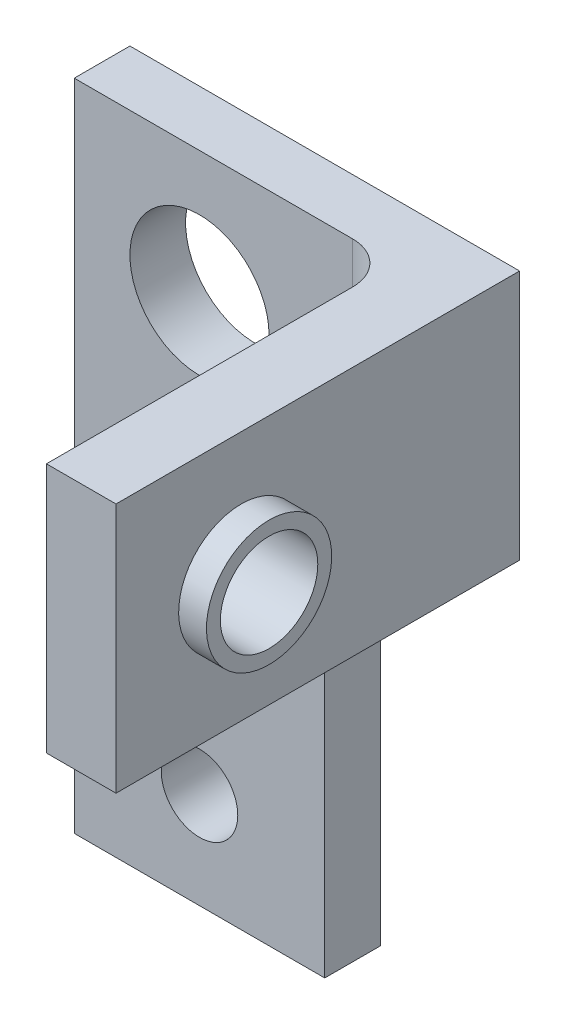
ISO-10303-21;
HEADER;
FILE_DESCRIPTION(('STEP AP214'),'2;1');
FILE_NAME('part.step','',(''),(''),'','','');
FILE_SCHEMA(('AUTOMOTIVE_DESIGN { 1 0 10303 214 1 1 1 1 }'));
ENDSEC;
DATA;
#1=APPLICATION_CONTEXT('core data for automotive mechanical design processes');
#2=APPLICATION_PROTOCOL_DEFINITION('international standard','automotive_design',2000,#1);
#3=PRODUCT_CONTEXT('',#1,'mechanical');
#4=PRODUCT('Part','Part','',(#3));
#5=PRODUCT_RELATED_PRODUCT_CATEGORY('part','',(#4));
#6=PRODUCT_DEFINITION_FORMATION('','',#4);
#7=PRODUCT_DEFINITION_CONTEXT('part definition',#1,'design');
#8=PRODUCT_DEFINITION('design','',#6,#7);
#9=PRODUCT_DEFINITION_SHAPE('','',#8);
#10=(LENGTH_UNIT() NAMED_UNIT(*) SI_UNIT(.MILLI.,.METRE.));
#11=(NAMED_UNIT(*) PLANE_ANGLE_UNIT() SI_UNIT($,.RADIAN.));
#12=(NAMED_UNIT(*) SI_UNIT($,.STERADIAN.) SOLID_ANGLE_UNIT());
#13=UNCERTAINTY_MEASURE_WITH_UNIT(LENGTH_MEASURE(1.E-05),#10,'distance_accuracy_value','');
#14=(GEOMETRIC_REPRESENTATION_CONTEXT(3) GLOBAL_UNCERTAINTY_ASSIGNED_CONTEXT((#13)) GLOBAL_UNIT_ASSIGNED_CONTEXT((#10,
#11,#12)) REPRESENTATION_CONTEXT('',''));
#15=CARTESIAN_POINT('',(0.,0.,0.));
#16=DIRECTION('',(0.,0.,1.));
#17=DIRECTION('',(1.,0.,0.));
#18=AXIS2_PLACEMENT_3D('',#15,#16,#17);
#19=CARTESIAN_POINT('',(4.5,11.,2.));
#20=DIRECTION('',(-1.,0.,0.));
#21=DIRECTION('',(0.,-1.,0.));
#22=AXIS2_PLACEMENT_3D('',#19,#20,#21);
#23=PLANE('',#22);
#24=DIRECTION('',(0.,1.,0.));
#25=VECTOR('',#24,1.);
#26=CARTESIAN_POINT('',(4.5,11.,0.));
#27=LINE('',#26,#25);
#28=CARTESIAN_POINT('',(4.5,-12.5,0.));
#29=VERTEX_POINT('',#28);
#30=CARTESIAN_POINT('',(4.5,0.499999999999999,0.));
#31=VERTEX_POINT('',#30);
#32=EDGE_CURVE('E128',#29,#31,#27,.T.);
#33=ORIENTED_EDGE('',*,*,#32,.T.);
#34=DIRECTION('',(0.,0.,-1.));
#35=VECTOR('',#34,1.);
#36=CARTESIAN_POINT('',(4.5,0.499999999999999,2.));
#37=LINE('',#36,#35);
#38=CARTESIAN_POINT('',(4.5,0.499999999999999,2.));
#39=VERTEX_POINT('',#38);
#40=EDGE_CURVE('E218',#31,#39,#37,.F.);
#41=ORIENTED_EDGE('',*,*,#40,.T.);
#42=DIRECTION('',(0.,1.,0.));
#43=VECTOR('',#42,1.);
#44=CARTESIAN_POINT('',(4.5,11.,2.));
#45=LINE('',#44,#43);
#46=CARTESIAN_POINT('',(4.5,-12.5,2.));
#47=VERTEX_POINT('',#46);
#48=EDGE_CURVE('E122',#47,#39,#45,.T.);
#49=ORIENTED_EDGE('',*,*,#48,.F.);
#50=DIRECTION('',(0.,0.,1.));
#51=VECTOR('',#50,1.);
#52=CARTESIAN_POINT('',(4.5,-12.5,2.));
#53=LINE('',#52,#51);
#54=EDGE_CURVE('E132',#29,#47,#53,.T.);
#55=ORIENTED_EDGE('',*,*,#54,.F.);
#56=EDGE_LOOP('',(#33,#41,#49,#55));
#57=FACE_BOUND('',#56,.T.);
#58=ADVANCED_FACE('F32',(#57),#23,.F.);
#59=CARTESIAN_POINT('',(-4.5,11.,2.));
#60=DIRECTION('',(0.,-1.,0.));
#61=DIRECTION('',(0.,0.,-1.));
#62=AXIS2_PLACEMENT_3D('',#59,#60,#61);
#63=PLANE('',#62);
#64=DIRECTION('',(-1.,0.,0.));
#65=VECTOR('',#64,1.);
#66=CARTESIAN_POINT('',(-4.5,11.,0.));
#67=LINE('',#66,#65);
#68=CARTESIAN_POINT('',(9.5,11.,0.));
#69=VERTEX_POINT('',#68);
#70=CARTESIAN_POINT('',(-4.5,11.,0.));
#71=VERTEX_POINT('',#70);
#72=EDGE_CURVE('E123',#69,#71,#67,.T.);
#73=ORIENTED_EDGE('',*,*,#72,.T.);
#74=DIRECTION('',(0.,0.,-1.));
#75=VECTOR('',#74,1.);
#76=CARTESIAN_POINT('',(-4.5,11.,2.));
#77=LINE('',#76,#75);
#78=CARTESIAN_POINT('',(-4.5,11.,2.));
#79=VERTEX_POINT('',#78);
#80=EDGE_CURVE('E121',#79,#71,#77,.T.);
#81=ORIENTED_EDGE('',*,*,#80,.F.);
#82=DIRECTION('',(-1.,0.,0.));
#83=VECTOR('',#82,1.);
#84=CARTESIAN_POINT('',(-4.5,11.,2.));
#85=LINE('',#84,#83);
#86=CARTESIAN_POINT('',(5.5,11.,2.));
#87=VERTEX_POINT('',#86);
#88=EDGE_CURVE('E196',#87,#79,#85,.T.);
#89=ORIENTED_EDGE('',*,*,#88,.F.);
#90=CARTESIAN_POINT('',(5.5,11.,3.5));
#91=DIRECTION('',(0.,-1.,0.));
#92=DIRECTION('',(0.,0.,-1.));
#93=AXIS2_PLACEMENT_3D('',#90,#91,#92);
#94=CIRCLE('',#93,1.5);
#95=CARTESIAN_POINT('',(7.,11.,3.5));
#96=VERTEX_POINT('',#95);
#97=EDGE_CURVE('E213',#87,#96,#94,.T.);
#98=ORIENTED_EDGE('',*,*,#97,.T.);
#99=DIRECTION('',(0.,0.,-1.));
#100=VECTOR('',#99,1.);
#101=CARTESIAN_POINT('',(7.,11.,14.5));
#102=LINE('',#101,#100);
#103=CARTESIAN_POINT('',(7.,11.,14.5));
#104=VERTEX_POINT('',#103);
#105=EDGE_CURVE('E170',#104,#96,#102,.T.);
#106=ORIENTED_EDGE('',*,*,#105,.F.);
#107=DIRECTION('',(-1.,0.,0.));
#108=VECTOR('',#107,1.);
#109=CARTESIAN_POINT('',(9.5,11.,14.5));
#110=LINE('',#109,#108);
#111=CARTESIAN_POINT('',(9.5,11.,14.5));
#112=VERTEX_POINT('',#111);
#113=EDGE_CURVE('E160',#112,#104,#110,.T.);
#114=ORIENTED_EDGE('',*,*,#113,.F.);
#115=DIRECTION('',(0.,0.,1.));
#116=VECTOR('',#115,1.);
#117=CARTESIAN_POINT('',(9.5,11.,2.));
#118=LINE('',#117,#116);
#119=EDGE_CURVE('E178',#69,#112,#118,.T.);
#120=ORIENTED_EDGE('',*,*,#119,.F.);
#121=EDGE_LOOP('',(#73,#81,#89,#98,#106,#114,#120));
#122=FACE_BOUND('',#121,.T.);
#123=ADVANCED_FACE('F241',(#122),#63,.F.);
#124=CARTESIAN_POINT('',(-4.5,11.,2.));
#125=DIRECTION('',(1.,0.,0.));
#126=DIRECTION('',(0.,1.,0.));
#127=AXIS2_PLACEMENT_3D('',#124,#125,#126);
#128=PLANE('',#127);
#129=DIRECTION('',(0.,-1.,0.));
#130=VECTOR('',#129,1.);
#131=CARTESIAN_POINT('',(-4.5,11.,0.));
#132=LINE('',#131,#130);
#133=CARTESIAN_POINT('',(-4.5,-12.5,0.));
#134=VERTEX_POINT('',#133);
#135=EDGE_CURVE('E114',#71,#134,#132,.T.);
#136=ORIENTED_EDGE('',*,*,#135,.T.);
#137=DIRECTION('',(0.,0.,-1.));
#138=VECTOR('',#137,1.);
#139=CARTESIAN_POINT('',(-4.5,-12.5,2.));
#140=LINE('',#139,#138);
#141=CARTESIAN_POINT('',(-4.5,-12.5,2.));
#142=VERTEX_POINT('',#141);
#143=EDGE_CURVE('E119',#142,#134,#140,.T.);
#144=ORIENTED_EDGE('',*,*,#143,.F.);
#145=DIRECTION('',(0.,-1.,0.));
#146=VECTOR('',#145,1.);
#147=CARTESIAN_POINT('',(-4.5,11.,2.));
#148=LINE('',#147,#146);
#149=EDGE_CURVE('E198',#79,#142,#148,.T.);
#150=ORIENTED_EDGE('',*,*,#149,.F.);
#151=ORIENTED_EDGE('',*,*,#80,.T.);
#152=EDGE_LOOP('',(#136,#144,#150,#151));
#153=FACE_BOUND('',#152,.T.);
#154=ADVANCED_FACE('F116',(#153),#128,.F.);
#155=CARTESIAN_POINT('',(0.,0.,2.));
#156=DIRECTION('',(0.,0.,1.));
#157=DIRECTION('',(1.,0.,0.));
#158=AXIS2_PLACEMENT_3D('',#155,#156,#157);
#159=PLANE('',#158);
#160=ORIENTED_EDGE('',*,*,#48,.T.);
#161=CARTESIAN_POINT('',(6.,0.499999999999999,2.));
#162=DIRECTION('',(0.,0.,1.));
#163=DIRECTION('',(1.,0.,0.));
#164=AXIS2_PLACEMENT_3D('',#161,#162,#163);
#165=CIRCLE('',#164,1.5);
#166=CARTESIAN_POINT('',(5.5,1.91421356237312,2.));
#167=VERTEX_POINT('',#166);
#168=EDGE_CURVE('E45',#39,#167,#165,.F.);
#169=ORIENTED_EDGE('',*,*,#168,.T.);
#170=DIRECTION('',(0.,-1.,0.));
#171=VECTOR('',#170,1.);
#172=CARTESIAN_POINT('',(5.5,0.,2.));
#173=LINE('',#172,#171);
#174=EDGE_CURVE('E51',#167,#87,#173,.F.);
#175=ORIENTED_EDGE('',*,*,#174,.T.);
#176=ORIENTED_EDGE('',*,*,#88,.T.);
#177=ORIENTED_EDGE('',*,*,#149,.T.);
#178=DIRECTION('',(-1.,0.,0.));
#179=VECTOR('',#178,1.);
#180=CARTESIAN_POINT('',(-4.5,-12.5,2.));
#181=LINE('',#180,#179);
#182=EDGE_CURVE('E137',#47,#142,#181,.T.);
#183=ORIENTED_EDGE('',*,*,#182,.F.);
#184=EDGE_LOOP('',(#160,#169,#175,#176,#177,#183));
#185=FACE_BOUND('',#184,.T.);
#186=CARTESIAN_POINT('',(0.,6.5,2.));
#187=DIRECTION('',(0.,0.,1.));
#188=DIRECTION('',(1.,0.,0.));
#189=AXIS2_PLACEMENT_3D('',#186,#187,#188);
#190=CIRCLE('',#189,2.5);
#191=CARTESIAN_POINT('',(2.5,6.5,2.));
#192=VERTEX_POINT('',#191);
#193=EDGE_CURVE('E186',#192,#192,#190,.T.);
#194=ORIENTED_EDGE('',*,*,#193,.F.);
#195=EDGE_LOOP('',(#194));
#196=FACE_BOUND('',#195,.T.);
#197=CARTESIAN_POINT('',(0.,-9.,2.));
#198=DIRECTION('',(0.,0.,1.));
#199=DIRECTION('',(1.,0.,0.));
#200=AXIS2_PLACEMENT_3D('',#197,#198,#199);
#201=CIRCLE('',#200,1.375);
#202=CARTESIAN_POINT('',(1.375,-9.,2.));
#203=VERTEX_POINT('',#202);
#204=EDGE_CURVE('E182',#203,#203,#201,.T.);
#205=ORIENTED_EDGE('',*,*,#204,.F.);
#206=EDGE_LOOP('',(#205));
#207=FACE_BOUND('',#206,.T.);
#208=ADVANCED_FACE('F223',(#185,#196,#207),#159,.T.);
#209=CARTESIAN_POINT('',(0.,0.,0.));
#210=DIRECTION('',(0.,0.,1.));
#211=DIRECTION('',(1.,0.,0.));
#212=AXIS2_PLACEMENT_3D('',#209,#210,#211);
#213=PLANE('',#212);
#214=CARTESIAN_POINT('',(0.,6.5,0.));
#215=DIRECTION('',(0.,0.,1.));
#216=DIRECTION('',(1.,0.,0.));
#217=AXIS2_PLACEMENT_3D('',#214,#215,#216);
#218=CIRCLE('',#217,2.5);
#219=CARTESIAN_POINT('',(2.5,6.5,0.));
#220=VERTEX_POINT('',#219);
#221=EDGE_CURVE('E183',#220,#220,#218,.T.);
#222=ORIENTED_EDGE('',*,*,#221,.T.);
#223=EDGE_LOOP('',(#222));
#224=FACE_BOUND('',#223,.T.);
#225=CARTESIAN_POINT('',(0.,-9.,0.));
#226=DIRECTION('',(0.,0.,1.));
#227=DIRECTION('',(1.,0.,0.));
#228=AXIS2_PLACEMENT_3D('',#225,#226,#227);
#229=CIRCLE('',#228,1.375);
#230=CARTESIAN_POINT('',(1.375,-9.,0.));
#231=VERTEX_POINT('',#230);
#232=EDGE_CURVE('E189',#231,#231,#229,.T.);
#233=ORIENTED_EDGE('',*,*,#232,.T.);
#234=EDGE_LOOP('',(#233));
#235=FACE_BOUND('',#234,.T.);
#236=ORIENTED_EDGE('',*,*,#32,.F.);
#237=DIRECTION('',(1.,0.,0.));
#238=VECTOR('',#237,1.);
#239=CARTESIAN_POINT('',(-4.5,-12.5,0.));
#240=LINE('',#239,#238);
#241=EDGE_CURVE('E126',#134,#29,#240,.T.);
#242=ORIENTED_EDGE('',*,*,#241,.F.);
#243=ORIENTED_EDGE('',*,*,#135,.F.);
#244=ORIENTED_EDGE('',*,*,#72,.F.);
#245=DIRECTION('',(0.,1.,0.));
#246=VECTOR('',#245,1.);
#247=CARTESIAN_POINT('',(9.5,11.,0.));
#248=LINE('',#247,#246);
#249=CARTESIAN_POINT('',(9.5,2.,0.));
#250=VERTEX_POINT('',#249);
#251=EDGE_CURVE('E175',#250,#69,#248,.T.);
#252=ORIENTED_EDGE('',*,*,#251,.F.);
#253=DIRECTION('',(-1.,0.,0.));
#254=VECTOR('',#253,1.);
#255=CARTESIAN_POINT('',(9.5,2.,0.));
#256=LINE('',#255,#254);
#257=CARTESIAN_POINT('',(6.,2.,0.));
#258=VERTEX_POINT('',#257);
#259=EDGE_CURVE('E180',#250,#258,#256,.T.);
#260=ORIENTED_EDGE('',*,*,#259,.T.);
#261=CARTESIAN_POINT('',(6.,0.499999999999999,0.));
#262=DIRECTION('',(0.,0.,1.));
#263=DIRECTION('',(1.,0.,0.));
#264=AXIS2_PLACEMENT_3D('',#261,#262,#263);
#265=CIRCLE('',#264,1.5);
#266=EDGE_CURVE('E59',#258,#31,#265,.T.);
#267=ORIENTED_EDGE('',*,*,#266,.T.);
#268=EDGE_LOOP('',(#236,#242,#243,#244,#252,#260,#267));
#269=FACE_BOUND('',#268,.T.);
#270=ADVANCED_FACE('F127',(#224,#235,#269),#213,.F.);
#271=CARTESIAN_POINT('',(0.,-9.,0.));
#272=DIRECTION('',(0.,0.,1.));
#273=DIRECTION('',(1.,0.,0.));
#274=AXIS2_PLACEMENT_3D('',#271,#272,#273);
#275=CYLINDRICAL_SURFACE('',#274,1.375);
#276=ORIENTED_EDGE('',*,*,#232,.F.);
#277=EDGE_LOOP('',(#276));
#278=FACE_BOUND('',#277,.T.);
#279=ORIENTED_EDGE('',*,*,#204,.T.);
#280=EDGE_LOOP('',(#279));
#281=FACE_BOUND('',#280,.T.);
#282=ADVANCED_FACE('F311',(#278,#281),#275,.F.);
#283=CARTESIAN_POINT('',(0.,6.5,0.));
#284=DIRECTION('',(0.,0.,1.));
#285=DIRECTION('',(1.,0.,0.));
#286=AXIS2_PLACEMENT_3D('',#283,#284,#285);
#287=CYLINDRICAL_SURFACE('',#286,2.5);
#288=ORIENTED_EDGE('',*,*,#221,.F.);
#289=EDGE_LOOP('',(#288));
#290=FACE_BOUND('',#289,.T.);
#291=ORIENTED_EDGE('',*,*,#193,.T.);
#292=EDGE_LOOP('',(#291));
#293=FACE_BOUND('',#292,.T.);
#294=ADVANCED_FACE('F306',(#290,#293),#287,.F.);
#295=CARTESIAN_POINT('',(9.5,2.,2.));
#296=DIRECTION('',(0.,1.,0.));
#297=DIRECTION('',(-1.,0.,0.));
#298=AXIS2_PLACEMENT_3D('',#295,#296,#297);
#299=PLANE('',#298);
#300=CARTESIAN_POINT('',(5.5,2.,3.5));
#301=DIRECTION('',(0.,1.,0.));
#302=DIRECTION('',(-1.,0.,0.));
#303=AXIS2_PLACEMENT_3D('',#300,#301,#302);
#304=CIRCLE('',#303,1.5);
#305=CARTESIAN_POINT('',(7.,2.,3.5));
#306=VERTEX_POINT('',#305);
#307=CARTESIAN_POINT('',(6.,2.,2.0857864376269));
#308=VERTEX_POINT('',#307);
#309=EDGE_CURVE('E210',#306,#308,#304,.T.);
#310=ORIENTED_EDGE('',*,*,#309,.T.);
#311=DIRECTION('',(0.,0.,-1.));
#312=VECTOR('',#311,1.);
#313=CARTESIAN_POINT('',(6.,2.,0.));
#314=LINE('',#313,#312);
#315=EDGE_CURVE('E215',#308,#258,#314,.T.);
#316=ORIENTED_EDGE('',*,*,#315,.T.);
#317=ORIENTED_EDGE('',*,*,#259,.F.);
#318=DIRECTION('',(0.,0.,-1.));
#319=VECTOR('',#318,1.);
#320=CARTESIAN_POINT('',(9.5,2.,2.));
#321=LINE('',#320,#319);
#322=CARTESIAN_POINT('',(9.5,2.,14.5));
#323=VERTEX_POINT('',#322);
#324=EDGE_CURVE('E173',#323,#250,#321,.T.);
#325=ORIENTED_EDGE('',*,*,#324,.F.);
#326=DIRECTION('',(1.,0.,0.));
#327=VECTOR('',#326,1.);
#328=CARTESIAN_POINT('',(9.5,2.,14.5));
#329=LINE('',#328,#327);
#330=CARTESIAN_POINT('',(7.,2.,14.5));
#331=VERTEX_POINT('',#330);
#332=EDGE_CURVE('E164',#331,#323,#329,.T.);
#333=ORIENTED_EDGE('',*,*,#332,.F.);
#334=DIRECTION('',(0.,0.,-1.));
#335=VECTOR('',#334,1.);
#336=CARTESIAN_POINT('',(7.,2.,14.5));
#337=LINE('',#336,#335);
#338=EDGE_CURVE('E167',#331,#306,#337,.T.);
#339=ORIENTED_EDGE('',*,*,#338,.T.);
#340=EDGE_LOOP('',(#310,#316,#317,#325,#333,#339));
#341=FACE_BOUND('',#340,.T.);
#342=ADVANCED_FACE('F232',(#341),#299,.F.);
#343=CARTESIAN_POINT('',(9.5,0.,0.));
#344=DIRECTION('',(1.,0.,0.));
#345=DIRECTION('',(0.,1.,0.));
#346=AXIS2_PLACEMENT_3D('',#343,#344,#345);
#347=PLANE('',#346);
#348=CARTESIAN_POINT('',(9.5,6.5,10.));
#349=DIRECTION('',(1.,0.,0.));
#350=DIRECTION('',(0.,1.,0.));
#351=AXIS2_PLACEMENT_3D('',#348,#349,#350);
#352=CIRCLE('',#351,2.25);
#353=CARTESIAN_POINT('',(9.5,8.75,10.));
#354=VERTEX_POINT('',#353);
#355=EDGE_CURVE('E151',#354,#354,#352,.T.);
#356=ORIENTED_EDGE('',*,*,#355,.F.);
#357=EDGE_LOOP('',(#356));
#358=FACE_BOUND('',#357,.T.);
#359=ORIENTED_EDGE('',*,*,#119,.T.);
#360=DIRECTION('',(0.,1.,0.));
#361=VECTOR('',#360,1.);
#362=CARTESIAN_POINT('',(9.5,11.,14.5));
#363=LINE('',#362,#361);
#364=EDGE_CURVE('E155',#323,#112,#363,.T.);
#365=ORIENTED_EDGE('',*,*,#364,.F.);
#366=ORIENTED_EDGE('',*,*,#324,.T.);
#367=ORIENTED_EDGE('',*,*,#251,.T.);
#368=EDGE_LOOP('',(#359,#365,#366,#367));
#369=FACE_BOUND('',#368,.T.);
#370=ADVANCED_FACE('F246',(#358,#369),#347,.T.);
#371=CARTESIAN_POINT('',(7.,11.,14.5));
#372=DIRECTION('',(1.,0.,0.));
#373=DIRECTION('',(0.,1.,0.));
#374=AXIS2_PLACEMENT_3D('',#371,#372,#373);
#375=PLANE('',#374);
#376=CARTESIAN_POINT('',(7.,6.5,10.));
#377=DIRECTION('',(1.,0.,0.));
#378=DIRECTION('',(0.,1.,0.));
#379=AXIS2_PLACEMENT_3D('',#376,#377,#378);
#380=CIRCLE('',#379,2.25);
#381=CARTESIAN_POINT('',(7.,8.75,10.));
#382=VERTEX_POINT('',#381);
#383=EDGE_CURVE('E203',#382,#382,#380,.F.);
#384=ORIENTED_EDGE('',*,*,#383,.F.);
#385=EDGE_LOOP('',(#384));
#386=FACE_BOUND('',#385,.T.);
#387=ORIENTED_EDGE('',*,*,#105,.T.);
#388=DIRECTION('',(0.,-1.,0.));
#389=VECTOR('',#388,1.);
#390=CARTESIAN_POINT('',(7.,11.,3.5));
#391=LINE('',#390,#389);
#392=EDGE_CURVE('E206',#96,#306,#391,.T.);
#393=ORIENTED_EDGE('',*,*,#392,.T.);
#394=ORIENTED_EDGE('',*,*,#338,.F.);
#395=DIRECTION('',(0.,-1.,0.));
#396=VECTOR('',#395,1.);
#397=CARTESIAN_POINT('',(7.,11.,14.5));
#398=LINE('',#397,#396);
#399=EDGE_CURVE('E162',#104,#331,#398,.T.);
#400=ORIENTED_EDGE('',*,*,#399,.F.);
#401=EDGE_LOOP('',(#387,#393,#394,#400));
#402=FACE_BOUND('',#401,.T.);
#403=ADVANCED_FACE('F238',(#386,#402),#375,.F.);
#404=CARTESIAN_POINT('',(0.,0.,14.5));
#405=DIRECTION('',(0.,0.,-1.));
#406=DIRECTION('',(-1.,0.,0.));
#407=AXIS2_PLACEMENT_3D('',#404,#405,#406);
#408=PLANE('',#407);
#409=ORIENTED_EDGE('',*,*,#364,.T.);
#410=ORIENTED_EDGE('',*,*,#113,.T.);
#411=ORIENTED_EDGE('',*,*,#399,.T.);
#412=ORIENTED_EDGE('',*,*,#332,.T.);
#413=EDGE_LOOP('',(#409,#410,#411,#412));
#414=FACE_BOUND('',#413,.T.);
#415=ADVANCED_FACE('F249',(#414),#408,.F.);
#416=CARTESIAN_POINT('',(9.5,6.5,10.));
#417=DIRECTION('',(-1.,0.,0.));
#418=DIRECTION('',(0.,-1.,0.));
#419=AXIS2_PLACEMENT_3D('',#416,#417,#418);
#420=CYLINDRICAL_SURFACE('',#419,1.75);
#421=CARTESIAN_POINT('',(10.5,6.5,10.));
#422=DIRECTION('',(1.,0.,0.));
#423=DIRECTION('',(0.,1.,0.));
#424=AXIS2_PLACEMENT_3D('',#421,#422,#423);
#425=CIRCLE('',#424,1.75);
#426=CARTESIAN_POINT('',(10.5,8.25,10.));
#427=VERTEX_POINT('',#426);
#428=EDGE_CURVE('E148',#427,#427,#425,.T.);
#429=ORIENTED_EDGE('',*,*,#428,.T.);
#430=EDGE_LOOP('',(#429));
#431=FACE_BOUND('',#430,.T.);
#432=CARTESIAN_POINT('',(6.,6.5,10.));
#433=DIRECTION('',(-1.,0.,0.));
#434=DIRECTION('',(0.,-1.,0.));
#435=AXIS2_PLACEMENT_3D('',#432,#433,#434);
#436=CIRCLE('',#435,1.75);
#437=CARTESIAN_POINT('',(6.,4.75,10.));
#438=VERTEX_POINT('',#437);
#439=EDGE_CURVE('E142',#438,#438,#436,.T.);
#440=ORIENTED_EDGE('',*,*,#439,.T.);
#441=EDGE_LOOP('',(#440));
#442=FACE_BOUND('',#441,.T.);
#443=ADVANCED_FACE('F251',(#431,#442),#420,.F.);
#444=CARTESIAN_POINT('',(10.5,6.5,10.));
#445=DIRECTION('',(-1.,0.,0.));
#446=DIRECTION('',(0.,-1.,0.));
#447=AXIS2_PLACEMENT_3D('',#444,#445,#446);
#448=CYLINDRICAL_SURFACE('',#447,2.25);
#449=CARTESIAN_POINT('',(10.5,6.5,10.));
#450=DIRECTION('',(1.,0.,0.));
#451=DIRECTION('',(0.,1.,0.));
#452=AXIS2_PLACEMENT_3D('',#449,#450,#451);
#453=CIRCLE('',#452,2.25);
#454=CARTESIAN_POINT('',(10.5,8.75,10.));
#455=VERTEX_POINT('',#454);
#456=EDGE_CURVE('E152',#455,#455,#453,.T.);
#457=ORIENTED_EDGE('',*,*,#456,.F.);
#458=EDGE_LOOP('',(#457));
#459=FACE_BOUND('',#458,.T.);
#460=ORIENTED_EDGE('',*,*,#355,.T.);
#461=EDGE_LOOP('',(#460));
#462=FACE_BOUND('',#461,.T.);
#463=ADVANCED_FACE('F257',(#459,#462),#448,.T.);
#464=CARTESIAN_POINT('',(10.5,6.5,10.));
#465=DIRECTION('',(1.,0.,0.));
#466=DIRECTION('',(0.,1.,0.));
#467=AXIS2_PLACEMENT_3D('',#464,#465,#466);
#468=PLANE('',#467);
#469=ORIENTED_EDGE('',*,*,#428,.F.);
#470=EDGE_LOOP('',(#469));
#471=FACE_BOUND('',#470,.T.);
#472=ORIENTED_EDGE('',*,*,#456,.T.);
#473=EDGE_LOOP('',(#472));
#474=FACE_BOUND('',#473,.T.);
#475=ADVANCED_FACE('F283',(#471,#474),#468,.T.);
#476=CARTESIAN_POINT('',(6.,6.5,10.));
#477=DIRECTION('',(1.,0.,0.));
#478=DIRECTION('',(0.,1.,0.));
#479=AXIS2_PLACEMENT_3D('',#476,#477,#478);
#480=CYLINDRICAL_SURFACE('',#479,2.25);
#481=CARTESIAN_POINT('',(6.,6.5,10.));
#482=DIRECTION('',(-1.,0.,0.));
#483=DIRECTION('',(0.,-1.,0.));
#484=AXIS2_PLACEMENT_3D('',#481,#482,#483);
#485=CIRCLE('',#484,2.25);
#486=CARTESIAN_POINT('',(6.,4.25,10.));
#487=VERTEX_POINT('',#486);
#488=EDGE_CURVE('E145',#487,#487,#485,.T.);
#489=ORIENTED_EDGE('',*,*,#488,.F.);
#490=EDGE_LOOP('',(#489));
#491=FACE_BOUND('',#490,.T.);
#492=ORIENTED_EDGE('',*,*,#383,.T.);
#493=EDGE_LOOP('',(#492));
#494=FACE_BOUND('',#493,.T.);
#495=ADVANCED_FACE('F277',(#491,#494),#480,.T.);
#496=CARTESIAN_POINT('',(6.,6.5,10.));
#497=DIRECTION('',(-1.,0.,0.));
#498=DIRECTION('',(0.,-1.,0.));
#499=AXIS2_PLACEMENT_3D('',#496,#497,#498);
#500=PLANE('',#499);
#501=ORIENTED_EDGE('',*,*,#439,.F.);
#502=EDGE_LOOP('',(#501));
#503=FACE_BOUND('',#502,.T.);
#504=ORIENTED_EDGE('',*,*,#488,.T.);
#505=EDGE_LOOP('',(#504));
#506=FACE_BOUND('',#505,.T.);
#507=ADVANCED_FACE('F272',(#503,#506),#500,.T.);
#508=CARTESIAN_POINT('',(5.5,11.,3.5));
#509=DIRECTION('',(0.,-1.,0.));
#510=DIRECTION('',(1.,0.,0.));
#511=AXIS2_PLACEMENT_3D('',#508,#509,#510);
#512=CYLINDRICAL_SURFACE('',#511,1.5);
#513=ORIENTED_EDGE('',*,*,#97,.F.);
#514=ORIENTED_EDGE('',*,*,#174,.F.);
#515=CARTESIAN_POINT('',(5.5,1.91421356237312,2.));
#516=CARTESIAN_POINT('',(5.52921140817877,1.92454287425045,1.99999907315903));
#517=CARTESIAN_POINT('',(5.55872927627042,1.93395781108983,2.00085479935597));
#518=CARTESIAN_POINT('',(5.61820385000759,1.95092709520268,2.00436730050247));
#519=CARTESIAN_POINT('',(5.64816075517887,1.95848056686237,2.00702492084772));
#520=CARTESIAN_POINT('',(5.73712520152415,1.9780107039795,2.01768009995659));
#521=CARTESIAN_POINT('',(5.79646852746809,1.98729200423225,2.02835426329494));
#522=CARTESIAN_POINT('',(5.87949213835872,1.99535331466673,2.04858039856048));
#523=CARTESIAN_POINT('',(5.90369822981791,1.9970999805892,2.05512636668006));
#524=CARTESIAN_POINT('',(5.95200506603074,1.99942775361194,2.06950028801688));
#525=CARTESIAN_POINT('',(5.97610323530249,1.99999898747282,2.07733850809605));
#526=CARTESIAN_POINT('',(6.,2.,2.0857864376269));
#527=B_SPLINE_CURVE_WITH_KNOTS('',3,(#515,#516,#517,#518,#519,#520,#521,#522,#523,#524,#525,
#526),.UNSPECIFIED.,.F.,.F.,(4,2,2,2,2,4),(0.,0.092890641555071,0.185824894850792,
0.367794606234113,0.443159744921027,0.519155383641057),.UNSPECIFIED.);
#528=EDGE_CURVE('E11',#167,#308,#527,.T.);
#529=ORIENTED_EDGE('',*,*,#528,.T.);
#530=ORIENTED_EDGE('',*,*,#309,.F.);
#531=ORIENTED_EDGE('',*,*,#392,.F.);
#532=EDGE_LOOP('',(#513,#514,#529,#530,#531));
#533=FACE_BOUND('',#532,.T.);
#534=ADVANCED_FACE('F229',(#533),#512,.F.);
#535=CARTESIAN_POINT('',(6.,0.499999999999999,2.));
#536=DIRECTION('',(0.,0.,1.));
#537=DIRECTION('',(1.,0.,0.));
#538=AXIS2_PLACEMENT_3D('',#535,#536,#537);
#539=CYLINDRICAL_SURFACE('',#538,1.5);
#540=ORIENTED_EDGE('',*,*,#168,.F.);
#541=ORIENTED_EDGE('',*,*,#40,.F.);
#542=ORIENTED_EDGE('',*,*,#266,.F.);
#543=ORIENTED_EDGE('',*,*,#315,.F.);
#544=ORIENTED_EDGE('',*,*,#528,.F.);
#545=EDGE_LOOP('',(#540,#541,#542,#543,#544));
#546=FACE_BOUND('',#545,.T.);
#547=ADVANCED_FACE('F34',(#546),#539,.F.);
#548=CARTESIAN_POINT('',(0.,-12.5,0.));
#549=DIRECTION('',(0.,-1.,0.));
#550=DIRECTION('',(0.,0.,-1.));
#551=AXIS2_PLACEMENT_3D('',#548,#549,#550);
#552=PLANE('',#551);
#553=ORIENTED_EDGE('',*,*,#143,.T.);
#554=ORIENTED_EDGE('',*,*,#241,.T.);
#555=ORIENTED_EDGE('',*,*,#54,.T.);
#556=ORIENTED_EDGE('',*,*,#182,.T.);
#557=EDGE_LOOP('',(#553,#554,#555,#556));
#558=FACE_BOUND('',#557,.T.);
#559=ADVANCED_FACE('F135',(#558),#552,.T.);
#560=CLOSED_SHELL('',(#58,#123,#154,#208,#270,#282,#294,#342,#370,#403,#415,#443,#463,#475,#495,
#507,#534,#547,#559));
#561=MANIFOLD_SOLID_BREP('B2',#560);
#562=ADVANCED_BREP_SHAPE_REPRESENTATION('',(#18,#561),#14);
#563=SHAPE_DEFINITION_REPRESENTATION(#9,#562);
ENDSEC;
END-ISO-10303-21;
